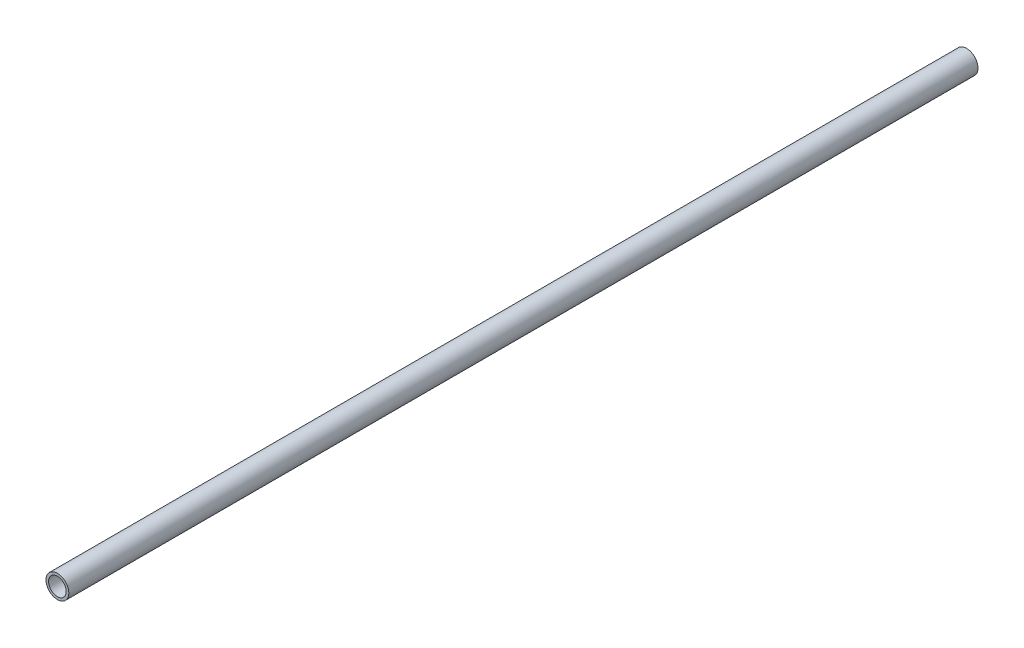
ISO-10303-21;
HEADER;
FILE_DESCRIPTION(('STEP AP214'),'2;1');
FILE_NAME('part.step','',(''),(''),'','','');
FILE_SCHEMA(('AUTOMOTIVE_DESIGN { 1 0 10303 214 1 1 1 1 }'));
ENDSEC;
DATA;
#1=APPLICATION_CONTEXT('core data for automotive mechanical design processes');
#2=APPLICATION_PROTOCOL_DEFINITION('international standard','automotive_design',2000,#1);
#3=PRODUCT_CONTEXT('',#1,'mechanical');
#4=PRODUCT('Part','Part','',(#3));
#5=PRODUCT_RELATED_PRODUCT_CATEGORY('part','',(#4));
#6=PRODUCT_DEFINITION_FORMATION('','',#4);
#7=PRODUCT_DEFINITION_CONTEXT('part definition',#1,'design');
#8=PRODUCT_DEFINITION('design','',#6,#7);
#9=PRODUCT_DEFINITION_SHAPE('','',#8);
#10=(LENGTH_UNIT() NAMED_UNIT(*) SI_UNIT(.MILLI.,.METRE.));
#11=(NAMED_UNIT(*) PLANE_ANGLE_UNIT() SI_UNIT($,.RADIAN.));
#12=(NAMED_UNIT(*) SI_UNIT($,.STERADIAN.) SOLID_ANGLE_UNIT());
#13=UNCERTAINTY_MEASURE_WITH_UNIT(LENGTH_MEASURE(1.E-05),#10,'distance_accuracy_value','');
#14=(GEOMETRIC_REPRESENTATION_CONTEXT(3) GLOBAL_UNCERTAINTY_ASSIGNED_CONTEXT((#13)) GLOBAL_UNIT_ASSIGNED_CONTEXT((#10,
#11,#12)) REPRESENTATION_CONTEXT('',''));
#15=CARTESIAN_POINT('',(0.,0.,0.));
#16=DIRECTION('',(0.,0.,1.));
#17=DIRECTION('',(1.,0.,0.));
#18=AXIS2_PLACEMENT_3D('',#15,#16,#17);
#19=CARTESIAN_POINT('',(0.,0.,1346.2));
#20=DIRECTION('',(0.,0.,1.));
#21=DIRECTION('',(1.,0.,0.));
#22=AXIS2_PLACEMENT_3D('',#19,#20,#21);
#23=PLANE('',#22);
#24=CARTESIAN_POINT('',(0.,0.,1346.2));
#25=DIRECTION('',(0.,0.,1.));
#26=DIRECTION('',(1.,0.,0.));
#27=AXIS2_PLACEMENT_3D('',#24,#25,#26);
#28=CIRCLE('',#27,16.891);
#29=CARTESIAN_POINT('',(16.891,0.,1346.2));
#30=VERTEX_POINT('',#29);
#31=EDGE_CURVE('E10',#30,#30,#28,.T.);
#32=ORIENTED_EDGE('',*,*,#31,.T.);
#33=EDGE_LOOP('',(#32));
#34=FACE_BOUND('',#33,.T.);
#35=CARTESIAN_POINT('',(0.,0.,1346.2));
#36=DIRECTION('',(0.,0.,1.));
#37=DIRECTION('',(1.,0.,0.));
#38=AXIS2_PLACEMENT_3D('',#35,#36,#37);
#39=CIRCLE('',#38,13.081);
#40=CARTESIAN_POINT('',(13.081,0.,1346.2));
#41=VERTEX_POINT('',#40);
#42=EDGE_CURVE('E44',#41,#41,#39,.T.);
#43=ORIENTED_EDGE('',*,*,#42,.F.);
#44=EDGE_LOOP('',(#43));
#45=FACE_BOUND('',#44,.T.);
#46=ADVANCED_FACE('F33',(#34,#45),#23,.T.);
#47=CARTESIAN_POINT('',(0.,0.,0.));
#48=DIRECTION('',(0.,0.,1.));
#49=DIRECTION('',(1.,0.,0.));
#50=AXIS2_PLACEMENT_3D('',#47,#48,#49);
#51=PLANE('',#50);
#52=CARTESIAN_POINT('',(0.,0.,0.));
#53=DIRECTION('',(0.,0.,1.));
#54=DIRECTION('',(1.,0.,0.));
#55=AXIS2_PLACEMENT_3D('',#52,#53,#54);
#56=CIRCLE('',#55,16.891);
#57=CARTESIAN_POINT('',(16.891,0.,0.));
#58=VERTEX_POINT('',#57);
#59=EDGE_CURVE('E37',#58,#58,#56,.T.);
#60=ORIENTED_EDGE('',*,*,#59,.F.);
#61=EDGE_LOOP('',(#60));
#62=FACE_BOUND('',#61,.T.);
#63=CARTESIAN_POINT('',(0.,0.,0.));
#64=DIRECTION('',(0.,0.,1.));
#65=DIRECTION('',(1.,0.,0.));
#66=AXIS2_PLACEMENT_3D('',#63,#64,#65);
#67=CIRCLE('',#66,13.081);
#68=CARTESIAN_POINT('',(13.081,0.,0.));
#69=VERTEX_POINT('',#68);
#70=EDGE_CURVE('E46',#69,#69,#67,.T.);
#71=ORIENTED_EDGE('',*,*,#70,.T.);
#72=EDGE_LOOP('',(#71));
#73=FACE_BOUND('',#72,.T.);
#74=ADVANCED_FACE('F56',(#62,#73),#51,.F.);
#75=CARTESIAN_POINT('',(0.,0.,1346.2));
#76=DIRECTION('',(0.,0.,-1.));
#77=DIRECTION('',(-1.,0.,0.));
#78=AXIS2_PLACEMENT_3D('',#75,#76,#77);
#79=CYLINDRICAL_SURFACE('',#78,16.891);
#80=ORIENTED_EDGE('',*,*,#31,.F.);
#81=EDGE_LOOP('',(#80));
#82=FACE_BOUND('',#81,.T.);
#83=ORIENTED_EDGE('',*,*,#59,.T.);
#84=EDGE_LOOP('',(#83));
#85=FACE_BOUND('',#84,.T.);
#86=ADVANCED_FACE('F35',(#82,#85),#79,.T.);
#87=CARTESIAN_POINT('',(0.,0.,1346.2));
#88=DIRECTION('',(0.,0.,-1.));
#89=DIRECTION('',(-1.,0.,0.));
#90=AXIS2_PLACEMENT_3D('',#87,#88,#89);
#91=CYLINDRICAL_SURFACE('',#90,13.081);
#92=ORIENTED_EDGE('',*,*,#42,.T.);
#93=EDGE_LOOP('',(#92));
#94=FACE_BOUND('',#93,.T.);
#95=ORIENTED_EDGE('',*,*,#70,.F.);
#96=EDGE_LOOP('',(#95));
#97=FACE_BOUND('',#96,.T.);
#98=ADVANCED_FACE('F52',(#94,#97),#91,.F.);
#99=CLOSED_SHELL('',(#46,#74,#86,#98));
#100=MANIFOLD_SOLID_BREP('B2',#99);
#101=ADVANCED_BREP_SHAPE_REPRESENTATION('',(#18,#100),#14);
#102=SHAPE_DEFINITION_REPRESENTATION(#9,#101);
ENDSEC;
END-ISO-10303-21;
